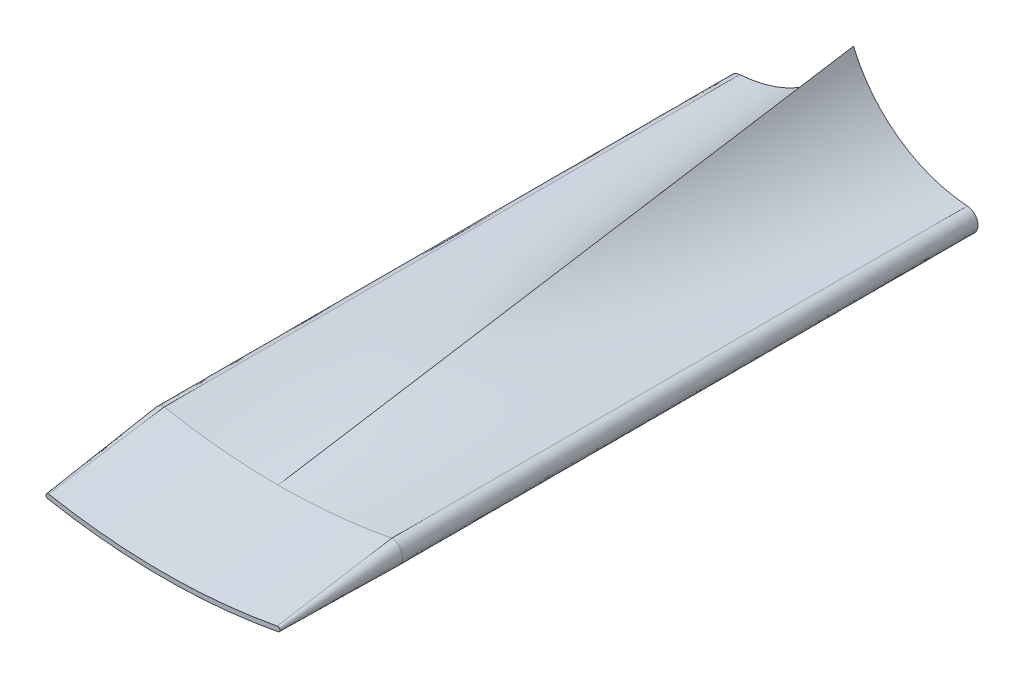
ISO-10303-21;
HEADER;
FILE_DESCRIPTION(('STEP AP214'),'2;1');
FILE_NAME('part.step','',(''),(''),'','','');
FILE_SCHEMA(('AUTOMOTIVE_DESIGN { 1 0 10303 214 1 1 1 1 }'));
ENDSEC;
DATA;
#1=APPLICATION_CONTEXT('core data for automotive mechanical design processes');
#2=APPLICATION_PROTOCOL_DEFINITION('international standard','automotive_design',2000,#1);
#3=PRODUCT_CONTEXT('',#1,'mechanical');
#4=PRODUCT('Part','Part','',(#3));
#5=PRODUCT_RELATED_PRODUCT_CATEGORY('part','',(#4));
#6=PRODUCT_DEFINITION_FORMATION('','',#4);
#7=PRODUCT_DEFINITION_CONTEXT('part definition',#1,'design');
#8=PRODUCT_DEFINITION('design','',#6,#7);
#9=PRODUCT_DEFINITION_SHAPE('','',#8);
#10=(LENGTH_UNIT() NAMED_UNIT(*) SI_UNIT(.MILLI.,.METRE.));
#11=(NAMED_UNIT(*) PLANE_ANGLE_UNIT() SI_UNIT($,.RADIAN.));
#12=(NAMED_UNIT(*) SI_UNIT($,.STERADIAN.) SOLID_ANGLE_UNIT());
#13=UNCERTAINTY_MEASURE_WITH_UNIT(LENGTH_MEASURE(1.E-05),#10,'distance_accuracy_value','');
#14=(GEOMETRIC_REPRESENTATION_CONTEXT(3) GLOBAL_UNCERTAINTY_ASSIGNED_CONTEXT((#13)) GLOBAL_UNIT_ASSIGNED_CONTEXT((#10,
#11,#12)) REPRESENTATION_CONTEXT('',''));
#15=CARTESIAN_POINT('',(0.,0.,0.));
#16=DIRECTION('',(0.,0.,1.));
#17=DIRECTION('',(1.,0.,0.));
#18=AXIS2_PLACEMENT_3D('',#15,#16,#17);
#19=CARTESIAN_POINT('',(-10.2219274367108,-45.8465663535967,0.));
#20=DIRECTION('',(0.,0.,-1.));
#21=DIRECTION('',(-1.,0.,0.));
#22=AXIS2_PLACEMENT_3D('',#19,#20,#21);
#23=PLANE('',#22);
#24=CARTESIAN_POINT('',(-9.81481481481481,-52.0832930040996,0.));
#25=DIRECTION('',(0.,0.,1.));
#26=DIRECTION('',(-1.,0.,0.));
#27=AXIS2_PLACEMENT_3D('',#24,#25,#26);
#28=CIRCLE('',#27,1.00000000000001);
#29=CARTESIAN_POINT('',(-9.87995283431818,-51.0854167400191,0.));
#30=VERTEX_POINT('',#29);
#31=CARTESIAN_POINT('',(-10.,-53.0659966456864,0.));
#32=VERTEX_POINT('',#31);
#33=EDGE_CURVE('E519',#30,#32,#28,.T.);
#34=ORIENTED_EDGE('',*,*,#33,.F.);
#35=CARTESIAN_POINT('',(-10.6290400586068,-39.6098397030938,0.));
#36=DIRECTION('',(0.,0.,-1.));
#37=DIRECTION('',(1.,0.,0.));
#38=AXIS2_PLACEMENT_3D('',#35,#36,#37);
#39=CIRCLE('',#38,11.5);
#40=CARTESIAN_POINT('',(0.,-44.,0.));
#41=VERTEX_POINT('',#40);
#42=EDGE_CURVE('E305',#41,#30,#39,.T.);
#43=ORIENTED_EDGE('',*,*,#42,.F.);
#44=CARTESIAN_POINT('',(10.6290400586068,-39.6098397030938,0.));
#45=DIRECTION('',(0.,0.,-1.));
#46=DIRECTION('',(1.,0.,0.));
#47=AXIS2_PLACEMENT_3D('',#44,#45,#46);
#48=CIRCLE('',#47,11.5);
#49=CARTESIAN_POINT('',(9.87995283431817,-51.0854167400191,0.));
#50=VERTEX_POINT('',#49);
#51=EDGE_CURVE('E506',#50,#41,#48,.T.);
#52=ORIENTED_EDGE('',*,*,#51,.F.);
#53=CARTESIAN_POINT('',(9.81481481481481,-52.0832930040996,0.));
#54=DIRECTION('',(0.,0.,1.));
#55=DIRECTION('',(1.,0.,0.));
#56=AXIS2_PLACEMENT_3D('',#53,#54,#55);
#57=CIRCLE('',#56,1.00000000000001);
#58=CARTESIAN_POINT('',(10.,-53.0659966456864,0.));
#59=VERTEX_POINT('',#58);
#60=EDGE_CURVE('E247',#59,#50,#57,.T.);
#61=ORIENTED_EDGE('',*,*,#60,.F.);
#62=CARTESIAN_POINT('',(0.,0.,0.));
#63=DIRECTION('',(0.,0.,1.));
#64=DIRECTION('',(1.,0.,0.));
#65=AXIS2_PLACEMENT_3D('',#62,#63,#64);
#66=CIRCLE('',#65,54.);
#67=EDGE_CURVE('E13',#32,#59,#66,.T.);
#68=ORIENTED_EDGE('',*,*,#67,.F.);
#69=EDGE_LOOP('',(#34,#43,#52,#61,#68));
#70=FACE_BOUND('',#69,.T.);
#71=ADVANCED_FACE('F237',(#70),#23,.T.);
#72=CARTESIAN_POINT('',(-9.87995283431817,-51.0854167400191,50.));
#73=CARTESIAN_POINT('',(-9.87995283431817,-51.0854167400191,33.3333333333333));
#74=CARTESIAN_POINT('',(-9.87995283431818,-51.0854167400191,16.6666666666667));
#75=CARTESIAN_POINT('',(-9.87995283431818,-51.0854167400191,0.));
#76=CARTESIAN_POINT('',(-9.06666425750124,-51.2427072799111,50.));
#77=CARTESIAN_POINT('',(-8.98268063593177,-51.1670986792632,33.3333333333333));
#78=CARTESIAN_POINT('',(-8.89869701436231,-51.0914900786154,16.6666666666667));
#79=CARTESIAN_POINT('',(-8.81471339279284,-51.0158814779676,0.));
#80=CARTESIAN_POINT('',(-7.43257359512714,-51.5184386259435,50.));
#81=CARTESIAN_POINT('',(-7.18964744343263,-51.2051008135142,33.3333333333333));
#82=CARTESIAN_POINT('',(-6.94672129173812,-50.8917630010849,16.6666666666667));
#83=CARTESIAN_POINT('',(-6.70379514004361,-50.5784251886556,0.));
#84=CARTESIAN_POINT('',(-4.9644862832223,-51.8145392173287,50.));
#85=CARTESIAN_POINT('',(-4.58961500888863,-50.901926391082,33.3333333333333));
#86=CARTESIAN_POINT('',(-4.21474373455497,-49.9893135648353,16.6666666666667));
#87=CARTESIAN_POINT('',(-3.8398724602213,-49.0767007385887,0.));
#88=CARTESIAN_POINT('',(-2.48507692828344,-51.9924711988439,50.));
#89=CARTESIAN_POINT('',(-2.15635773455314,-50.2768954664481,33.3333333333333));
#90=CARTESIAN_POINT('',(-1.82763854082284,-48.5613197340524,16.6666666666667));
#91=CARTESIAN_POINT('',(-1.49891934709253,-46.8457440016567,0.));
#92=CARTESIAN_POINT('',(-0.828358994108471,-52.0320408163064,50.));
#93=CARTESIAN_POINT('',(-0.688080629232665,-49.6835799590987,33.3333333333333));
#94=CARTESIAN_POINT('',(-0.547802264356859,-47.335119101891,16.6666666666667));
#95=CARTESIAN_POINT('',(-0.407523899481053,-44.9866582446833,0.));
#96=CARTESIAN_POINT('',(0.,-52.0320408163064,50.));
#97=CARTESIAN_POINT('',(0.,-49.3546938775376,33.3333333333333));
#98=CARTESIAN_POINT('',(0.,-46.6773469387688,16.6666666666667));
#99=CARTESIAN_POINT('',(0.,-44.,0.));
#100=B_SPLINE_SURFACE_WITH_KNOTS('',3,3,((#72,#73,#74,#75),(#76,#77,#78,#79),(#80,#81,#82,#83),
(#84,#85,#86,#87),(#88,#89,#90,#91),(#92,#93,#94,#95),(#96,#97,#98,#99)),.UNSPECIFIED.,.F.,.F.,
.F.,(4,1,1,1,4),(4,4),(0.767097188680693,0.825322891510519,0.883548594340346,0.941774297170173,
1.),(0.,1.),.UNSPECIFIED.);
#101=CARTESIAN_POINT('',(0.,0.,50.));
#102=DIRECTION('',(0.,0.,-1.));
#103=DIRECTION('',(1.,0.,0.));
#104=AXIS2_PLACEMENT_3D('',#101,#102,#103);
#105=CIRCLE('',#104,52.0320408163064);
#106=CARTESIAN_POINT('',(0.,-52.0320408163064,50.));
#107=VERTEX_POINT('',#106);
#108=CARTESIAN_POINT('',(-9.87995283431817,-51.0854167400191,50.));
#109=VERTEX_POINT('',#108);
#110=EDGE_CURVE('E301',#107,#109,#105,.T.);
#111=CARTESIAN_POINT('',(0.,-52.0320408163064,50.));
#112=CARTESIAN_POINT('',(0.,-49.3546938775376,33.3333333333333));
#113=CARTESIAN_POINT('',(0.,-46.6773469387688,16.6666666666667));
#114=CARTESIAN_POINT('',(0.,-44.,0.));
#115=B_SPLINE_CURVE_WITH_KNOTS('',3,(#111,#112,#113,#114),.UNSPECIFIED.,.F.,.F.,(4,4),(0.,1.),.UNSPECIFIED.);
#116=EDGE_CURVE('E307',#107,#41,#115,.T.);
#117=CARTESIAN_POINT('',(-9.87995283431817,-51.0854167400191,50.));
#118=CARTESIAN_POINT('',(-9.87995283431817,-51.0854167400191,33.3333333333333));
#119=CARTESIAN_POINT('',(-9.87995283431818,-51.0854167400191,16.6666666666667));
#120=CARTESIAN_POINT('',(-9.87995283431818,-51.0854167400191,0.));
#121=B_SPLINE_CURVE_WITH_KNOTS('',3,(#117,#118,#119,#120),.UNSPECIFIED.,.F.,.F.,(4,4),(0.,1.),.UNSPECIFIED.);
#122=EDGE_CURVE('E296',#109,#30,#121,.T.);
#123=ORIENTED_EDGE('',*,*,#110,.F.);
#124=ORIENTED_EDGE('',*,*,#116,.T.);
#125=ORIENTED_EDGE('',*,*,#42,.T.);
#126=ORIENTED_EDGE('',*,*,#122,.F.);
#127=EDGE_LOOP('',(#123,#124,#125,#126));
#128=FACE_BOUND('',#127,.T.);
#129=ADVANCED_FACE('F298',(#128),#100,.T.);
#130=CARTESIAN_POINT('',(9.87995283431818,-51.0854167400191,50.));
#131=CARTESIAN_POINT('',(9.87995283431818,-51.0854167400191,33.3333333333333));
#132=CARTESIAN_POINT('',(9.87995283431817,-51.0854167400191,16.6666666666667));
#133=CARTESIAN_POINT('',(9.87995283431817,-51.0854167400191,0.));
#134=CARTESIAN_POINT('',(10.0974031985306,-51.0996111713078,50.));
#135=CARTESIAN_POINT('',(10.1136154745072,-51.1006694543703,33.3333333333333));
#136=CARTESIAN_POINT('',(10.1298277504839,-51.1017277374329,16.6666666666667));
#137=CARTESIAN_POINT('',(10.1460400264606,-51.1027860204954,0.));
#138=CARTESIAN_POINT('',(10.5448127366525,-51.2775106141117,49.9999999999999));
#139=CARTESIAN_POINT('',(10.571864553868,-51.3019648007856,33.3333333333333));
#140=CARTESIAN_POINT('',(10.5989163710835,-51.3264189874594,16.6666666666666));
#141=CARTESIAN_POINT('',(10.6259681882989,-51.3508731741333,0.));
#142=CARTESIAN_POINT('',(10.9072905918241,-51.9688326781849,50.0000000000001));
#143=CARTESIAN_POINT('',(10.9047462159921,-51.9984735159467,33.3333333333334));
#144=CARTESIAN_POINT('',(10.9022018401602,-52.0281143537085,16.6666666666667));
#145=CARTESIAN_POINT('',(10.8996574643283,-52.0577551914703,0.));
#146=CARTESIAN_POINT('',(10.6901116743578,-52.7486765841442,50.));
#147=CARTESIAN_POINT('',(10.6811326699347,-52.7523507555751,33.3333333333333));
#148=CARTESIAN_POINT('',(10.6721536655116,-52.756024927006,16.6666666666667));
#149=CARTESIAN_POINT('',(10.6631746610885,-52.7596990984369,0.));
#150=CARTESIAN_POINT('',(10.2366799262583,-53.0213955939358,50.));
#151=CARTESIAN_POINT('',(10.2366799262583,-53.0213955939359,33.3333333333333));
#152=CARTESIAN_POINT('',(10.2366799262583,-53.0213955939359,16.6666666666667));
#153=CARTESIAN_POINT('',(10.2366799262583,-53.021395593936,0.));
#154=CARTESIAN_POINT('',(8.35265190866591,-53.37643048194,50.));
#155=CARTESIAN_POINT('',(8.3526519086659,-53.37643048194,33.3333333333333));
#156=CARTESIAN_POINT('',(8.35265190866589,-53.37643048194,16.6666666666667));
#157=CARTESIAN_POINT('',(8.35265190866588,-53.37643048194,0.));
#158=CARTESIAN_POINT('',(5.02902756001228,-53.8437802426261,50.));
#159=CARTESIAN_POINT('',(5.02902756001226,-53.8437802426261,33.3333333333333));
#160=CARTESIAN_POINT('',(5.02902756001224,-53.8437802426261,16.6666666666667));
#161=CARTESIAN_POINT('',(5.02902756001222,-53.843780242626,0.));
#162=CARTESIAN_POINT('',(0.,-54.078116754049,50.));
#163=CARTESIAN_POINT('',(0.,-54.0781167540491,33.3333333333334));
#164=CARTESIAN_POINT('',(0.,-54.0781167540491,16.6666666666667));
#165=CARTESIAN_POINT('',(0.,-54.0781167540491,0.));
#166=CARTESIAN_POINT('',(-5.0290275600123,-53.8437802426261,50.));
#167=CARTESIAN_POINT('',(-5.02902756001228,-53.8437802426261,33.3333333333333));
#168=CARTESIAN_POINT('',(-5.02902756001227,-53.8437802426261,16.6666666666667));
#169=CARTESIAN_POINT('',(-5.02902756001225,-53.8437802426261,0.));
#170=CARTESIAN_POINT('',(-8.35265190866593,-53.37643048194,50.));
#171=CARTESIAN_POINT('',(-8.35265190866592,-53.37643048194,33.3333333333333));
#172=CARTESIAN_POINT('',(-8.35265190866591,-53.37643048194,16.6666666666667));
#173=CARTESIAN_POINT('',(-8.3526519086659,-53.37643048194,0.));
#174=CARTESIAN_POINT('',(-10.2366799262583,-53.0213955939358,50.));
#175=CARTESIAN_POINT('',(-10.2366799262583,-53.0213955939359,33.3333333333333));
#176=CARTESIAN_POINT('',(-10.2366799262584,-53.0213955939359,16.6666666666667));
#177=CARTESIAN_POINT('',(-10.2366799262584,-53.0213955939359,0.));
#178=CARTESIAN_POINT('',(-10.6901116743579,-52.7486765841442,50.));
#179=CARTESIAN_POINT('',(-10.6811326699347,-52.7523507555751,33.3333333333333));
#180=CARTESIAN_POINT('',(-10.6721536655116,-52.7560249270059,16.6666666666667));
#181=CARTESIAN_POINT('',(-10.6631746610885,-52.7596990984368,0.));
#182=CARTESIAN_POINT('',(-10.9072905918241,-51.9688326781848,50.));
#183=CARTESIAN_POINT('',(-10.9047462159922,-51.9984735159467,33.3333333333334));
#184=CARTESIAN_POINT('',(-10.9022018401603,-52.0281143537086,16.6666666666667));
#185=CARTESIAN_POINT('',(-10.8996574643284,-52.0577551914705,0.));
#186=CARTESIAN_POINT('',(-10.5448127366525,-51.2775106141118,50.));
#187=CARTESIAN_POINT('',(-10.571864553868,-51.3019648007856,33.3333333333333));
#188=CARTESIAN_POINT('',(-10.5989163710834,-51.3264189874593,16.6666666666667));
#189=CARTESIAN_POINT('',(-10.6259681882989,-51.3508731741331,0.));
#190=CARTESIAN_POINT('',(-10.0974031985306,-51.0996111713078,50.));
#191=CARTESIAN_POINT('',(-10.1136154745072,-51.1006694543703,33.3333333333333));
#192=CARTESIAN_POINT('',(-10.1298277504839,-51.1017277374328,16.6666666666667));
#193=CARTESIAN_POINT('',(-10.1460400264606,-51.1027860204953,0.));
#194=CARTESIAN_POINT('',(-9.87995283431817,-51.0854167400191,50.));
#195=CARTESIAN_POINT('',(-9.87995283431817,-51.0854167400191,33.3333333333333));
#196=CARTESIAN_POINT('',(-9.87995283431818,-51.0854167400191,16.6666666666667));
#197=CARTESIAN_POINT('',(-9.87995283431818,-51.0854167400191,0.));
#198=B_SPLINE_SURFACE_WITH_KNOTS('',3,3,((#130,#131,#132,#133),(#134,#135,#136,#137),(#138,#139,
#140,#141),(#142,#143,#144,#145),(#146,#147,#148,#149),(#150,#151,#152,#153),(#154,#155,#156,
#157),(#158,#159,#160,#161),(#162,#163,#164,#165),(#166,#167,#168,#169),(#170,#171,#172,#173),
(#174,#175,#176,#177),(#178,#179,#180,#181),(#182,#183,#184,#185),(#186,#187,#188,#189),(#190,
#191,#192,#193),(#194,#195,#196,#197)),.UNSPECIFIED.,.F.,.F.,.F.,(4,1,1,1,2,1,1,1,2,1,1,1,4),(4,
4),(0.232902811319307,0.247807396145084,0.262711980970861,0.277616565796638,0.292521150622415,
0.396260575311208,0.5,0.603739424688793,0.707478849377586,0.722383434203362,0.737288019029139,
0.752192603854916,0.767097188680693),(0.,1.),.UNSPECIFIED.);
#199=CARTESIAN_POINT('',(9.81481481481452,-52.0832930040996,50.));
#200=DIRECTION('',(0.,0.,1.));
#201=DIRECTION('',(-1.,0.,0.));
#202=AXIS2_PLACEMENT_3D('',#199,#200,#201);
#203=CIRCLE('',#202,1.00000000000004);
#204=CARTESIAN_POINT('',(10.,-53.0659966456864,50.));
#205=VERTEX_POINT('',#204);
#206=CARTESIAN_POINT('',(9.87995283431818,-51.0854167400191,50.));
#207=VERTEX_POINT('',#206);
#208=EDGE_CURVE('E478',#205,#207,#203,.T.);
#209=CARTESIAN_POINT('',(0.,0.,50.));
#210=DIRECTION('',(0.,0.,1.));
#211=DIRECTION('',(1.,0.,0.));
#212=AXIS2_PLACEMENT_3D('',#209,#210,#211);
#213=CIRCLE('',#212,54.);
#214=CARTESIAN_POINT('',(-10.,-53.0659966456864,50.));
#215=VERTEX_POINT('',#214);
#216=EDGE_CURVE('E314',#215,#205,#213,.T.);
#217=CARTESIAN_POINT('',(-9.81481481481452,-52.0832930040996,50.));
#218=DIRECTION('',(0.,0.,1.));
#219=DIRECTION('',(-1.,0.,0.));
#220=AXIS2_PLACEMENT_3D('',#217,#218,#219);
#221=CIRCLE('',#220,1.00000000000004);
#222=EDGE_CURVE('E241',#109,#215,#221,.T.);
#223=CARTESIAN_POINT('',(9.87995283431818,-51.0854167400191,50.));
#224=CARTESIAN_POINT('',(9.87995283431818,-51.0854167400191,33.3333333333333));
#225=CARTESIAN_POINT('',(9.87995283431817,-51.0854167400191,16.6666666666667));
#226=CARTESIAN_POINT('',(9.87995283431817,-51.0854167400191,0.));
#227=B_SPLINE_CURVE_WITH_KNOTS('',3,(#223,#224,#225,#226),.UNSPECIFIED.,.F.,.F.,(4,4),(0.,1.),.UNSPECIFIED.);
#228=EDGE_CURVE('E308',#207,#50,#227,.T.);
#229=ORIENTED_EDGE('',*,*,#208,.F.);
#230=ORIENTED_EDGE('',*,*,#216,.F.);
#231=ORIENTED_EDGE('',*,*,#222,.F.);
#232=ORIENTED_EDGE('',*,*,#122,.T.);
#233=ORIENTED_EDGE('',*,*,#33,.T.);
#234=ORIENTED_EDGE('',*,*,#67,.T.);
#235=ORIENTED_EDGE('',*,*,#60,.T.);
#236=ORIENTED_EDGE('',*,*,#228,.F.);
#237=EDGE_LOOP('',(#229,#230,#231,#232,#233,#234,#235,#236));
#238=FACE_BOUND('',#237,.T.);
#239=ADVANCED_FACE('F312',(#238),#198,.T.);
#240=CARTESIAN_POINT('',(0.,-52.0320408163064,50.));
#241=CARTESIAN_POINT('',(0.,-49.3546938775376,33.3333333333333));
#242=CARTESIAN_POINT('',(0.,-46.6773469387688,16.6666666666667));
#243=CARTESIAN_POINT('',(0.,-44.,0.));
#244=CARTESIAN_POINT('',(0.828358994108478,-52.0320408163064,50.));
#245=CARTESIAN_POINT('',(0.68808062923267,-49.6835799590987,33.3333333333333));
#246=CARTESIAN_POINT('',(0.547802264356863,-47.335119101891,16.6666666666667));
#247=CARTESIAN_POINT('',(0.407523899481056,-44.9866582446833,0.));
#248=CARTESIAN_POINT('',(2.48507692828344,-51.9924711988438,50.));
#249=CARTESIAN_POINT('',(2.15635773455314,-50.2768954664481,33.3333333333333));
#250=CARTESIAN_POINT('',(1.82763854082284,-48.5613197340523,16.6666666666667));
#251=CARTESIAN_POINT('',(1.49891934709254,-46.8457440016566,0.));
#252=CARTESIAN_POINT('',(4.96448628322232,-51.8145392173287,50.));
#253=CARTESIAN_POINT('',(4.58961500888865,-50.9019263910821,33.3333333333333));
#254=CARTESIAN_POINT('',(4.21474373455497,-49.9893135648354,16.6666666666667));
#255=CARTESIAN_POINT('',(3.8398724602213,-49.0767007385888,0.));
#256=CARTESIAN_POINT('',(7.43257359512714,-51.5184386259435,50.));
#257=CARTESIAN_POINT('',(7.18964744343263,-51.2051008135142,33.3333333333333));
#258=CARTESIAN_POINT('',(6.94672129173812,-50.8917630010849,16.6666666666667));
#259=CARTESIAN_POINT('',(6.70379514004361,-50.5784251886556,0.));
#260=CARTESIAN_POINT('',(9.06666425750126,-51.242707279911,50.));
#261=CARTESIAN_POINT('',(8.98268063593178,-51.1670986792632,33.3333333333333));
#262=CARTESIAN_POINT('',(8.89869701436231,-51.0914900786154,16.6666666666667));
#263=CARTESIAN_POINT('',(8.81471339279283,-51.0158814779676,0.));
#264=CARTESIAN_POINT('',(9.87995283431818,-51.0854167400191,50.));
#265=CARTESIAN_POINT('',(9.87995283431818,-51.0854167400191,33.3333333333333));
#266=CARTESIAN_POINT('',(9.87995283431817,-51.0854167400191,16.6666666666667));
#267=CARTESIAN_POINT('',(9.87995283431817,-51.0854167400191,0.));
#268=B_SPLINE_SURFACE_WITH_KNOTS('',3,3,((#240,#241,#242,#243),(#244,#245,#246,#247),(#248,#249,
#250,#251),(#252,#253,#254,#255),(#256,#257,#258,#259),(#260,#261,#262,#263),(#264,#265,#266,
#267)),.UNSPECIFIED.,.F.,.F.,.F.,(4,1,1,1,4),(4,4),(0.,0.0582257028298268,0.116451405659654,
0.174677108489481,0.232902811319307),(0.,1.),.UNSPECIFIED.);
#269=EDGE_CURVE('E330',#207,#107,#105,.T.);
#270=ORIENTED_EDGE('',*,*,#269,.F.);
#271=ORIENTED_EDGE('',*,*,#228,.T.);
#272=ORIENTED_EDGE('',*,*,#51,.T.);
#273=ORIENTED_EDGE('',*,*,#116,.F.);
#274=EDGE_LOOP('',(#270,#271,#272,#273));
#275=FACE_BOUND('',#274,.T.);
#276=ADVANCED_FACE('F448',(#275),#268,.T.);
#277=CARTESIAN_POINT('',(-4.9814814814815,-26.4347279586845,60.));
#278=DIRECTION('',(0.,0.,-1.));
#279=DIRECTION('',(-1.,0.,0.));
#280=AXIS2_PLACEMENT_3D('',#277,#278,#279);
#281=PLANE('',#280);
#282=CARTESIAN_POINT('',(-9.96296296296299,-52.869455917369,60.));
#283=DIRECTION('',(0.,0.,1.));
#284=DIRECTION('',(-1.,0.,0.));
#285=AXIS2_PLACEMENT_3D('',#282,#283,#284);
#286=CIRCLE('',#285,0.200000000000003);
#287=CARTESIAN_POINT('',(-9.92592592592596,-52.6729151890517,60.));
#288=VERTEX_POINT('',#287);
#289=CARTESIAN_POINT('',(-10.,-53.0659966456864,60.));
#290=VERTEX_POINT('',#289);
#291=EDGE_CURVE('E339',#288,#290,#286,.T.);
#292=ORIENTED_EDGE('',*,*,#291,.T.);
#293=CARTESIAN_POINT('',(0.,0.,60.));
#294=DIRECTION('',(0.,0.,1.));
#295=DIRECTION('',(1.,0.,0.));
#296=AXIS2_PLACEMENT_3D('',#293,#294,#295);
#297=CIRCLE('',#296,54.);
#298=CARTESIAN_POINT('',(10.,-53.0659966456864,60.));
#299=VERTEX_POINT('',#298);
#300=EDGE_CURVE('E319',#290,#299,#297,.T.);
#301=ORIENTED_EDGE('',*,*,#300,.T.);
#302=CARTESIAN_POINT('',(9.96296296296298,-52.869455917369,60.));
#303=DIRECTION('',(0.,0.,1.));
#304=DIRECTION('',(-1.,0.,0.));
#305=AXIS2_PLACEMENT_3D('',#302,#303,#304);
#306=CIRCLE('',#305,0.199999999999999);
#307=CARTESIAN_POINT('',(9.92592592592594,-52.6729151890517,60.));
#308=VERTEX_POINT('',#307);
#309=EDGE_CURVE('E429',#299,#308,#306,.T.);
#310=ORIENTED_EDGE('',*,*,#309,.T.);
#311=CARTESIAN_POINT('',(0.,0.,60.));
#312=DIRECTION('',(0.,0.,-1.));
#313=DIRECTION('',(1.,0.,0.));
#314=AXIS2_PLACEMENT_3D('',#311,#312,#313);
#315=CIRCLE('',#314,53.6);
#316=EDGE_CURVE('E343',#308,#288,#315,.T.);
#317=ORIENTED_EDGE('',*,*,#316,.T.);
#318=EDGE_LOOP('',(#292,#301,#310,#317));
#319=FACE_BOUND('',#318,.T.);
#320=ADVANCED_FACE('F439',(#319),#281,.F.);
#321=CARTESIAN_POINT('',(9.87995283431819,-51.0854167400191,50.));
#322=CARTESIAN_POINT('',(9.89527719818744,-51.6145828896966,53.3333333333333));
#323=CARTESIAN_POINT('',(9.91060156205669,-52.1437490393742,56.6666666666667));
#324=CARTESIAN_POINT('',(9.92592592592594,-52.6729151890517,60.));
#325=CARTESIAN_POINT('',(8.98333737534605,-51.2588227531334,50.));
#326=CARTESIAN_POINT('',(9.05011554792028,-51.7768114841614,53.3333333333333));
#327=CARTESIAN_POINT('',(9.11689372049451,-52.2948002151893,56.6666666666667));
#328=CARTESIAN_POINT('',(9.18367189306874,-52.8127889462173,60.));
#329=CARTESIAN_POINT('',(7.27892486507716,-51.540492964036,50.));
#330=CARTESIAN_POINT('',(7.39599601159265,-52.051323186205,53.3333333333333));
#331=CARTESIAN_POINT('',(7.51306715810813,-52.562153408374,56.6666666666667));
#332=CARTESIAN_POINT('',(7.63013830462362,-53.0729836305429,60.));
#333=CARTESIAN_POINT('',(4.84383151232466,-51.8248858106949,50.));
#334=CARTESIAN_POINT('',(4.93871971537026,-52.3415321002367,53.3333333333333));
#335=CARTESIAN_POINT('',(5.03360791841586,-52.8581783897786,56.6666666666667));
#336=CARTESIAN_POINT('',(5.12849612146147,-53.3748246793204,60.));
#337=CARTESIAN_POINT('',(2.44748612452237,-51.9928699991459,50.));
#338=CARTESIAN_POINT('',(2.47806008838412,-52.5155275405875,53.3333333333333));
#339=CARTESIAN_POINT('',(2.50863405224586,-53.038185082029,56.6666666666667));
#340=CARTESIAN_POINT('',(2.53920801610761,-53.5608426234706,60.));
#341=CARTESIAN_POINT('',(0.828358994108477,-52.0320408163064,50.));
#342=CARTESIAN_POINT('',(0.82956022567209,-52.5546938775376,53.3333333333333));
#343=CARTESIAN_POINT('',(0.830761457235704,-53.0773469387688,56.6666666666667));
#344=CARTESIAN_POINT('',(0.831962688799317,-53.6,60.));
#345=CARTESIAN_POINT('',(-0.828358994108471,-52.0320408163064,50.));
#346=CARTESIAN_POINT('',(-0.829560225672084,-52.5546938775376,53.3333333333333));
#347=CARTESIAN_POINT('',(-0.830761457235697,-53.0773469387688,56.6666666666667));
#348=CARTESIAN_POINT('',(-0.831962688799311,-53.6,60.));
#349=CARTESIAN_POINT('',(-2.44748612452238,-51.992869999146,50.0000000000001));
#350=CARTESIAN_POINT('',(-2.47806008838412,-52.5155275405875,53.3333333333334));
#351=CARTESIAN_POINT('',(-2.50863405224586,-53.038185082029,56.6666666666667));
#352=CARTESIAN_POINT('',(-2.53920801610761,-53.5608426234705,60.));
#353=CARTESIAN_POINT('',(-4.84383151232465,-51.8248858106949,50.));
#354=CARTESIAN_POINT('',(-4.93871971537025,-52.3415321002367,53.3333333333333));
#355=CARTESIAN_POINT('',(-5.03360791841586,-52.8581783897786,56.6666666666667));
#356=CARTESIAN_POINT('',(-5.12849612146146,-53.3748246793204,60.));
#357=CARTESIAN_POINT('',(-7.27892486507715,-51.540492964036,50.));
#358=CARTESIAN_POINT('',(-7.39599601159264,-52.051323186205,53.3333333333333));
#359=CARTESIAN_POINT('',(-7.51306715810814,-52.5621534083739,56.6666666666667));
#360=CARTESIAN_POINT('',(-7.63013830462363,-53.0729836305429,60.));
#361=CARTESIAN_POINT('',(-8.98333737534603,-51.2588227531334,50.));
#362=CARTESIAN_POINT('',(-9.05011554792027,-51.7768114841613,53.3333333333333));
#363=CARTESIAN_POINT('',(-9.11689372049451,-52.2948002151893,56.6666666666667));
#364=CARTESIAN_POINT('',(-9.18367189306875,-52.8127889462173,60.));
#365=CARTESIAN_POINT('',(-9.87995283431817,-51.0854167400191,50.));
#366=CARTESIAN_POINT('',(-9.89527719818743,-51.6145828896966,53.3333333333333));
#367=CARTESIAN_POINT('',(-9.91060156205669,-52.1437490393741,56.6666666666667));
#368=CARTESIAN_POINT('',(-9.92592592592595,-52.6729151890517,60.));
#369=B_SPLINE_SURFACE_WITH_KNOTS('',3,3,((#321,#322,#323,#324),(#325,#326,#327,#328),(#329,#330,
#331,#332),(#333,#334,#335,#336),(#337,#338,#339,#340),(#341,#342,#343,#344),(#345,#346,#347,
#348),(#349,#350,#351,#352),(#353,#354,#355,#356),(#357,#358,#359,#360),(#361,#362,#363,#364),
(#365,#366,#367,#368)),.UNSPECIFIED.,.F.,.F.,.F.,(4,1,1,1,2,1,1,1,4),(4,4),(0.541354326013033,
0.598685035261404,0.656015744509775,0.713346453758146,0.770677163006517,0.828007872254887,
0.885338581503258,0.942669290751629,1.),(0.,1.),.UNSPECIFIED.);
#370=CARTESIAN_POINT('',(-9.87995283431817,-51.0854167400191,50.));
#371=CARTESIAN_POINT('',(-9.89527719818743,-51.6145828896966,53.3333333333333));
#372=CARTESIAN_POINT('',(-9.91060156205669,-52.1437490393741,56.6666666666667));
#373=CARTESIAN_POINT('',(-9.92592592592595,-52.6729151890517,60.));
#374=B_SPLINE_CURVE_WITH_KNOTS('',3,(#370,#371,#372,#373),.UNSPECIFIED.,.F.,.F.,(4,4),(0.,1.),.UNSPECIFIED.);
#375=EDGE_CURVE('E328',#109,#288,#374,.T.);
#376=CARTESIAN_POINT('',(9.87995283431819,-51.0854167400191,50.));
#377=CARTESIAN_POINT('',(9.89527719818744,-51.6145828896966,53.3333333333333));
#378=CARTESIAN_POINT('',(9.91060156205669,-52.1437490393742,56.6666666666667));
#379=CARTESIAN_POINT('',(9.92592592592594,-52.6729151890517,60.));
#380=B_SPLINE_CURVE_WITH_KNOTS('',3,(#376,#377,#378,#379),.UNSPECIFIED.,.F.,.F.,(4,4),(0.,1.),.UNSPECIFIED.);
#381=EDGE_CURVE('E341',#207,#308,#380,.T.);
#382=ORIENTED_EDGE('',*,*,#269,.T.);
#383=ORIENTED_EDGE('',*,*,#110,.T.);
#384=ORIENTED_EDGE('',*,*,#375,.T.);
#385=ORIENTED_EDGE('',*,*,#316,.F.);
#386=ORIENTED_EDGE('',*,*,#381,.F.);
#387=EDGE_LOOP('',(#382,#383,#384,#385,#386));
#388=FACE_BOUND('',#387,.T.);
#389=ADVANCED_FACE('F326',(#388),#369,.T.);
#390=CARTESIAN_POINT('',(-9.87995283431817,-51.0854167400191,50.));
#391=CARTESIAN_POINT('',(-9.89527719818743,-51.6145828896966,53.3333333333333));
#392=CARTESIAN_POINT('',(-9.91060156205669,-52.1437490393741,56.6666666666667));
#393=CARTESIAN_POINT('',(-9.92592592592595,-52.6729151890517,60.));
#394=CARTESIAN_POINT('',(-9.89940826972984,-51.0866867256645,50.));
#395=CARTESIAN_POINT('',(-9.91352969564837,-51.6144341434241,53.3333333333333));
#396=CARTESIAN_POINT('',(-9.9276511215669,-52.1421815611837,56.6666666666667));
#397=CARTESIAN_POINT('',(-9.94177254748543,-52.6699289789433,60.));
#398=CARTESIAN_POINT('',(-9.93928847634181,-51.0903748934593,50.));
#399=CARTESIAN_POINT('',(-9.94793664854532,-51.6165072006969,53.3333333333333));
#400=CARTESIAN_POINT('',(-9.95658482074883,-52.1426395079345,56.6666666666667));
#401=CARTESIAN_POINT('',(-9.96523299295233,-52.6687718151721,60.));
#402=CARTESIAN_POINT('',(-10.0232113391698,-51.1035055665398,50.));
#403=CARTESIAN_POINT('',(-10.0164531468724,-51.6263611744225,53.3333333333333));
#404=CARTESIAN_POINT('',(-10.009694954575,-52.1492167823052,56.6666666666666));
#405=CARTESIAN_POINT('',(-10.0029367622776,-52.6720723901878,60.));
#406=CARTESIAN_POINT('',(-10.1364540853052,-51.1328861997015,50.));
#407=CARTESIAN_POINT('',(-10.1039127437887,-51.6495907425604,53.3333333333333));
#408=CARTESIAN_POINT('',(-10.0713714022722,-52.1662952854193,56.6666666666667));
#409=CARTESIAN_POINT('',(-10.0388300607558,-52.6829998282782,60.0000000000001));
#410=CARTESIAN_POINT('',(-10.2873986875255,-51.1958599352435,50.));
#411=CARTESIAN_POINT('',(-10.2160042475021,-51.6976342006779,53.3333333333333));
#412=CARTESIAN_POINT('',(-10.1446098074786,-52.1994084661123,56.6666666666666));
#413=CARTESIAN_POINT('',(-10.0732153674551,-52.7011827315467,60.));
#414=CARTESIAN_POINT('',(-10.4423076587997,-51.2957902697822,50.));
#415=CARTESIAN_POINT('',(-10.3284086404814,-51.7715627929732,53.3333333333334));
#416=CARTESIAN_POINT('',(-10.214509622163,-52.2473353161642,56.6666666666667));
#417=CARTESIAN_POINT('',(-10.1006106038446,-52.7231078393553,60.0000000000001));
#418=CARTESIAN_POINT('',(-10.5900920613239,-51.4419168265659,50.));
#419=CARTESIAN_POINT('',(-10.4342689347317,-51.8771308941083,53.3333333333333));
#420=CARTESIAN_POINT('',(-10.2784458081395,-52.3123449616507,56.6666666666666));
#421=CARTESIAN_POINT('',(-10.1226226815474,-52.7475590291931,60.));
#422=CARTESIAN_POINT('',(-10.7522989604582,-51.6814639882812,50.));
#423=CARTESIAN_POINT('',(-10.5499654792101,-52.0486002642579,53.3333333333334));
#424=CARTESIAN_POINT('',(-10.347631997962,-52.4157365402346,56.6666666666667));
#425=CARTESIAN_POINT('',(-10.1452985167139,-52.7828728162113,60.));
#426=CARTESIAN_POINT('',(-10.8242380843991,-51.9627539635172,49.9999999999999));
#427=CARTESIAN_POINT('',(-10.6024465923785,-52.2489078194444,53.3333333333333));
#428=CARTESIAN_POINT('',(-10.380655100358,-52.5350616753715,56.6666666666666));
#429=CARTESIAN_POINT('',(-10.1588636083374,-52.8212155312987,59.9999999999999));
#430=CARTESIAN_POINT('',(-10.8088947632239,-52.2489933517266,50.));
#431=CARTESIAN_POINT('',(-10.5937874975619,-52.4530927330832,53.3333333333333));
#432=CARTESIAN_POINT('',(-10.3786802318999,-52.6571921144398,56.6666666666667));
#433=CARTESIAN_POINT('',(-10.1635729662379,-52.8612914957964,60.));
#434=CARTESIAN_POINT('',(-10.7521846752894,-52.4562337789163,50.0000000000001));
#435=CARTESIAN_POINT('',(-10.5556172659023,-52.601467469904,53.3333333333334));
#436=CARTESIAN_POINT('',(-10.3590498565151,-52.7467011608918,56.6666666666667));
#437=CARTESIAN_POINT('',(-10.162482447128,-52.8919348518795,60.));
#438=CARTESIAN_POINT('',(-10.6487106158069,-52.646121271685,50.));
#439=CARTESIAN_POINT('',(-10.4846764851695,-52.7383781795785,53.3333333333333));
#440=CARTESIAN_POINT('',(-10.320642354532,-52.8306350874719,56.6666666666667));
#441=CARTESIAN_POINT('',(-10.1566082238946,-52.9228919953653,60.));
#442=CARTESIAN_POINT('',(-10.5174491574908,-52.8042839074606,50.));
#443=CARTESIAN_POINT('',(-10.3933943232107,-52.8541373462521,53.3333333333333));
#444=CARTESIAN_POINT('',(-10.2693394889306,-52.9039907850436,56.6666666666667));
#445=CARTESIAN_POINT('',(-10.1452846546505,-52.9538442238351,60.));
#446=CARTESIAN_POINT('',(-10.3773768730553,-52.9163497636711,50.));
#447=CARTESIAN_POINT('',(-10.2942614154675,-52.9390619982865,53.3333333333333));
#448=CARTESIAN_POINT('',(-10.2111459578797,-52.9617742329019,56.6666666666666));
#449=CARTESIAN_POINT('',(-10.128030500292,-52.9844864675173,60.));
#450=CARTESIAN_POINT('',(-10.2391257271133,-52.9918849185129,50.));
#451=CARTESIAN_POINT('',(-10.193671683212,-52.9993506938105,53.3333333333334));
#452=CARTESIAN_POINT('',(-10.1482176393107,-53.006816469108,56.6666666666668));
#453=CARTESIAN_POINT('',(-10.1027635954095,-53.0142822444056,60.0000000000001));
#454=CARTESIAN_POINT('',(-10.1342940247501,-53.0323603615711,50.));
#455=CARTESIAN_POINT('',(-10.1139934465332,-53.0342154939492,53.3333333333333));
#456=CARTESIAN_POINT('',(-10.0936928683162,-53.0360706263274,56.6666666666666));
#457=CARTESIAN_POINT('',(-10.0733922900993,-53.0379257587056,59.9999999999999));
#458=CARTESIAN_POINT('',(-10.0558833662631,-53.054419426007,50.));
#459=CARTESIAN_POINT('',(-10.050293147529,-53.0546599260948,53.3333333333334));
#460=CARTESIAN_POINT('',(-10.044702928795,-53.0549004261826,56.6666666666667));
#461=CARTESIAN_POINT('',(-10.0391127100609,-53.0551409262704,60.0000000000001));
#462=CARTESIAN_POINT('',(-10.0183676301292,-53.0625353651508,50.));
#463=CARTESIAN_POINT('',(-10.0177657005053,-53.0626487955322,53.3333333333333));
#464=CARTESIAN_POINT('',(-10.0171637708815,-53.0627622259136,56.6666666666667));
#465=CARTESIAN_POINT('',(-10.0165618412576,-53.062875656295,60.));
#466=CARTESIAN_POINT('',(-8.2629130235158,-53.3933412893916,50.));
#467=CARTESIAN_POINT('',(-8.3198394812235,-53.3826138063881,53.3333333333333));
#468=CARTESIAN_POINT('',(-8.37676593893119,-53.3718863233847,56.6666666666667));
#469=CARTESIAN_POINT('',(-8.43369239663889,-53.3611588403813,60.));
#470=CARTESIAN_POINT('',(-4.90247845143919,-53.8527860949336,49.9999999999999));
#471=CARTESIAN_POINT('',(-4.98903226691171,-53.8462062313977,53.3333333333333));
#472=CARTESIAN_POINT('',(-5.07558608238423,-53.8396263678617,56.6666666666667));
#473=CARTESIAN_POINT('',(-5.16213989785675,-53.8330465043258,60.0000000000001));
#474=CARTESIAN_POINT('',(0.,-54.0736168591194,50.0000000000001));
#475=CARTESIAN_POINT('',(0.,-54.076981765146,53.3333333333334));
#476=CARTESIAN_POINT('',(0.,-54.0803466711725,56.6666666666667));
#477=CARTESIAN_POINT('',(0.,-54.0837115771991,60.));
#478=CARTESIAN_POINT('',(4.90247845143916,-53.8527860949336,50.));
#479=CARTESIAN_POINT('',(4.98903226691168,-53.8462062313977,53.3333333333333));
#480=CARTESIAN_POINT('',(5.07558608238421,-53.8396263678617,56.6666666666667));
#481=CARTESIAN_POINT('',(5.16213989785673,-53.8330465043258,60.0000000000001));
#482=CARTESIAN_POINT('',(8.26291302351578,-53.3933412893916,50.));
#483=CARTESIAN_POINT('',(8.31983948122348,-53.3826138063881,53.3333333333333));
#484=CARTESIAN_POINT('',(8.37676593893117,-53.3718863233847,56.6666666666667));
#485=CARTESIAN_POINT('',(8.43369239663886,-53.3611588403813,60.));
#486=CARTESIAN_POINT('',(10.0183676301291,-53.0625353651508,50.));
#487=CARTESIAN_POINT('',(10.0177657005053,-53.0626487955322,53.3333333333333));
#488=CARTESIAN_POINT('',(10.0171637708814,-53.0627622259136,56.6666666666667));
#489=CARTESIAN_POINT('',(10.0165618412576,-53.062875656295,60.));
#490=CARTESIAN_POINT('',(10.055904254482,-53.0544241383373,50.));
#491=CARTESIAN_POINT('',(10.0503070730083,-53.0546630676483,53.3333333333333));
#492=CARTESIAN_POINT('',(10.0447098915346,-53.0549019969593,56.6666666666667));
#493=CARTESIAN_POINT('',(10.0391127100609,-53.0551409262703,60.));
#494=CARTESIAN_POINT('',(10.1343976431491,-53.032384789355,50.));
#495=CARTESIAN_POINT('',(10.1140625254658,-53.0342317791386,53.3333333333334));
#496=CARTESIAN_POINT('',(10.0937274077826,-53.0360787689221,56.6666666666667));
#497=CARTESIAN_POINT('',(10.0733922900993,-53.0379257587057,60.));
#498=CARTESIAN_POINT('',(10.2393296731283,-52.9919372386115,50.));
#499=CARTESIAN_POINT('',(10.193807647222,-52.9993855738762,53.3333333333333));
#500=CARTESIAN_POINT('',(10.1482856213157,-53.0068339091409,56.6666666666666));
#501=CARTESIAN_POINT('',(10.1027635954094,-53.0142822444056,60.));
#502=CARTESIAN_POINT('',(10.3774406812331,-52.9163894001762,50.));
#503=CARTESIAN_POINT('',(10.2943039542527,-52.9390884226233,53.3333333333333));
#504=CARTESIAN_POINT('',(10.2111672272723,-52.9617874450703,56.6666666666667));
#505=CARTESIAN_POINT('',(10.1280305002919,-52.9844864675174,60.));
#506=CARTESIAN_POINT('',(10.5173430263049,-52.8043027508945,50.));
#507=CARTESIAN_POINT('',(10.3933235690868,-52.8541499085414,53.3333333333333));
#508=CARTESIAN_POINT('',(10.2693041118687,-52.9039970661883,56.6666666666667));
#509=CARTESIAN_POINT('',(10.1452846546505,-52.9538442238352,60.0000000000001));
#510=CARTESIAN_POINT('',(10.6486354731814,-52.6461492574632,50.));
#511=CARTESIAN_POINT('',(10.4846263900858,-52.7383968367639,53.3333333333333));
#512=CARTESIAN_POINT('',(10.3206173069901,-52.8306444160646,56.6666666666666));
#513=CARTESIAN_POINT('',(10.1566082238945,-52.9228919953653,59.9999999999999));
#514=CARTESIAN_POINT('',(10.7522016728015,-52.4562782543517,50.));
#515=CARTESIAN_POINT('',(10.555628597577,-52.6014971201943,53.3333333333334));
#516=CARTESIAN_POINT('',(10.3590555223525,-52.7467159860369,56.6666666666667));
#517=CARTESIAN_POINT('',(10.162482447128,-52.8919348518795,60.0000000000001));
#518=CARTESIAN_POINT('',(10.8089252761044,-52.2490390760294,50.));
#519=CARTESIAN_POINT('',(10.5938078394822,-52.4531232159517,53.3333333333333));
#520=CARTESIAN_POINT('',(10.3786904028601,-52.6572073558741,56.6666666666666));
#521=CARTESIAN_POINT('',(10.1635729662379,-52.8612914957964,59.9999999999999));
#522=CARTESIAN_POINT('',(10.8242322225622,-51.9627926341381,50.));
#523=CARTESIAN_POINT('',(10.6024426844873,-52.2489335998583,53.3333333333334));
#524=CARTESIAN_POINT('',(10.3806531464123,-52.5350745655785,56.6666666666668));
#525=CARTESIAN_POINT('',(10.1588636083374,-52.8212155312987,60.0000000000001));
#526=CARTESIAN_POINT('',(10.7522507878159,-51.6814999302832,49.9999999999999));
#527=CARTESIAN_POINT('',(10.5499333641153,-52.0486242255926,53.3333333333333));
#528=CARTESIAN_POINT('',(10.3476159404146,-52.415748520902,56.6666666666666));
#529=CARTESIAN_POINT('',(10.1452985167139,-52.7828728162114,59.9999999999999));
#530=CARTESIAN_POINT('',(10.5901715288439,-51.4419529189177,50.));
#531=CARTESIAN_POINT('',(10.4343219130784,-51.8771549556762,53.3333333333333));
#532=CARTESIAN_POINT('',(10.2784722973129,-52.3123569924346,56.6666666666667));
#533=CARTESIAN_POINT('',(10.1226226815474,-52.747559029193,60.));
#534=CARTESIAN_POINT('',(10.4424212189087,-51.2958215630016,50.0000000000001));
#535=CARTESIAN_POINT('',(10.3284843472207,-51.7715836551196,53.3333333333334));
#536=CARTESIAN_POINT('',(10.2145474755326,-52.2473457472375,56.6666666666667));
#537=CARTESIAN_POINT('',(10.1006106038446,-52.7231078393555,60.0000000000001));
#538=CARTESIAN_POINT('',(10.2873380896744,-51.1958751660569,50.));
#539=CARTESIAN_POINT('',(10.2159638489346,-51.6976443545535,53.3333333333333));
#540=CARTESIAN_POINT('',(10.1445896081949,-52.19941354305,56.6666666666666));
#541=CARTESIAN_POINT('',(10.0732153674551,-52.7011827315466,59.9999999999999));
#542=CARTESIAN_POINT('',(10.1362483152316,-51.1328863718381,50.));
#543=CARTESIAN_POINT('',(10.1037755637396,-51.6495908573182,53.3333333333333));
#544=CARTESIAN_POINT('',(10.0713028122477,-52.1662953427983,56.6666666666667));
#545=CARTESIAN_POINT('',(10.0388300607557,-52.6829998282783,60.0000000000001));
#546=CARTESIAN_POINT('',(10.0231064439313,-51.1035042487231,50.));
#547=CARTESIAN_POINT('',(10.0163832167134,-51.626360295878,53.3333333333333));
#548=CARTESIAN_POINT('',(10.0096599894955,-52.1492163430329,56.6666666666667));
#549=CARTESIAN_POINT('',(10.0029367622776,-52.6720723901878,60.));
#550=CARTESIAN_POINT('',(9.93926729627395,-51.0903744895075,50.));
#551=CARTESIAN_POINT('',(9.94792252850007,-51.6165069313957,53.3333333333333));
#552=CARTESIAN_POINT('',(9.95657776072619,-52.1426393732839,56.6666666666667));
#553=CARTESIAN_POINT('',(9.96523299295231,-52.6687718151722,60.));
#554=CARTESIAN_POINT('',(9.89940826972985,-51.0866867256645,50.));
#555=CARTESIAN_POINT('',(9.91352969564837,-51.6144341434241,53.3333333333333));
#556=CARTESIAN_POINT('',(9.92765112156689,-52.1421815611837,56.6666666666667));
#557=CARTESIAN_POINT('',(9.94177254748541,-52.6699289789433,60.));
#558=CARTESIAN_POINT('',(9.87995283431819,-51.0854167400191,50.));
#559=CARTESIAN_POINT('',(9.89527719818744,-51.6145828896966,53.3333333333333));
#560=CARTESIAN_POINT('',(9.91060156205669,-52.1437490393742,56.6666666666667));
#561=CARTESIAN_POINT('',(9.92592592592594,-52.6729151890517,60.));
#562=B_SPLINE_SURFACE_WITH_KNOTS('',3,3,((#390,#391,#392,#393),(#394,#395,#396,#397),(#398,#399,
#400,#401),(#402,#403,#404,#405),(#406,#407,#408,#409),(#410,#411,#412,#413),(#414,#415,#416,
#417),(#418,#419,#420,#421),(#422,#423,#424,#425),(#426,#427,#428,#429),(#430,#431,#432,#433),
(#434,#435,#436,#437),(#438,#439,#440,#441),(#442,#443,#444,#445),(#446,#447,#448,#449),(#450,
#451,#452,#453),(#454,#455,#456,#457),(#458,#459,#460,#461),(#462,#463,#464,#465),(#466,#467,
#468,#469),(#470,#471,#472,#473),(#474,#475,#476,#477),(#478,#479,#480,#481),(#482,#483,#484,
#485),(#486,#487,#488,#489),(#490,#491,#492,#493),(#494,#495,#496,#497),(#498,#499,#500,#501),
(#502,#503,#504,#505),(#506,#507,#508,#509),(#510,#511,#512,#513),(#514,#515,#516,#517),(#518,
#519,#520,#521),(#522,#523,#524,#525),(#526,#527,#528,#529),(#530,#531,#532,#533),(#534,#535,
#536,#537),(#538,#539,#540,#541),(#542,#543,#544,#545),(#546,#547,#548,#549),(#550,#551,#552,
#553),(#554,#555,#556,#557),(#558,#559,#560,#561)),.UNSPECIFIED.,.F.,.F.,.F.,(4,1,1,1,1,1,1,1,1,
1,1,1,1,1,1,1,1,2,1,1,1,2,1,1,1,1,1,1,1,1,1,1,1,1,1,1,1,1,4),(4,4),(0.,0.00122397187441542,
0.00244794374883078,0.00489588749766162,0.00734383124649249,0.00979177499532324,
0.012239718744154,0.0146876624929849,0.0195835499906465,0.0220314937394774,0.0244794374883082,
0.0269273812371389,0.0293753249859698,0.0318232687348006,0.0342712124836314,0.0367191562324621,
0.0379431281068776,0.039167099981293,0.154922131493905,0.270677163006517,0.386432194519129,
0.50218722603174,0.503411197906156,0.504635169780571,0.507083113529402,0.509531057278233,
0.511979001027064,0.514426944775894,0.516874888524725,0.519322832273556,0.521770776022387,
0.526666663520049,0.529114607268879,0.53156255101771,0.534010494766541,0.536458438515372,
0.538906382264203,0.540130354138618,0.541354326013033),(0.,1.),.UNSPECIFIED.);
#563=ORIENTED_EDGE('',*,*,#222,.T.);
#564=ORIENTED_EDGE('',*,*,#216,.T.);
#565=ORIENTED_EDGE('',*,*,#208,.T.);
#566=ORIENTED_EDGE('',*,*,#381,.T.);
#567=ORIENTED_EDGE('',*,*,#309,.F.);
#568=ORIENTED_EDGE('',*,*,#300,.F.);
#569=ORIENTED_EDGE('',*,*,#291,.F.);
#570=ORIENTED_EDGE('',*,*,#375,.F.);
#571=EDGE_LOOP('',(#563,#564,#565,#566,#567,#568,#569,#570));
#572=FACE_BOUND('',#571,.T.);
#573=ADVANCED_FACE('F337',(#572),#562,.T.);
#574=CLOSED_SHELL('',(#71,#129,#239,#276,#320,#389,#573));
#575=MANIFOLD_SOLID_BREP('B2',#574);
#576=ADVANCED_BREP_SHAPE_REPRESENTATION('',(#18,#575),#14);
#577=SHAPE_DEFINITION_REPRESENTATION(#9,#576);
ENDSEC;
END-ISO-10303-21;
